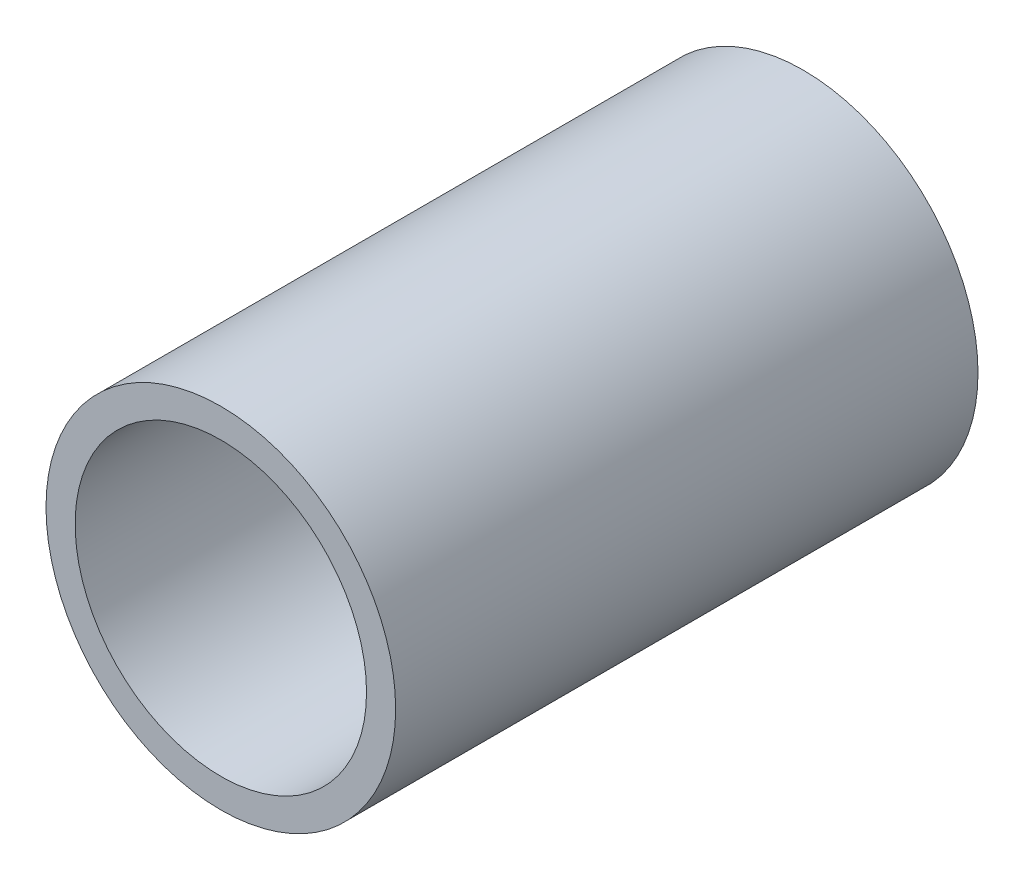
ISO-10303-21;
HEADER;
FILE_DESCRIPTION(('STEP AP214'),'2;1');
FILE_NAME('part.step','',(''),(''),'','','');
FILE_SCHEMA(('AUTOMOTIVE_DESIGN { 1 0 10303 214 1 1 1 1 }'));
ENDSEC;
DATA;
#1=APPLICATION_CONTEXT('core data for automotive mechanical design processes');
#2=APPLICATION_PROTOCOL_DEFINITION('international standard','automotive_design',2000,#1);
#3=PRODUCT_CONTEXT('',#1,'mechanical');
#4=PRODUCT('Part','Part','',(#3));
#5=PRODUCT_RELATED_PRODUCT_CATEGORY('part','',(#4));
#6=PRODUCT_DEFINITION_FORMATION('','',#4);
#7=PRODUCT_DEFINITION_CONTEXT('part definition',#1,'design');
#8=PRODUCT_DEFINITION('design','',#6,#7);
#9=PRODUCT_DEFINITION_SHAPE('','',#8);
#10=(LENGTH_UNIT() NAMED_UNIT(*) SI_UNIT(.MILLI.,.METRE.));
#11=(NAMED_UNIT(*) PLANE_ANGLE_UNIT() SI_UNIT($,.RADIAN.));
#12=(NAMED_UNIT(*) SI_UNIT($,.STERADIAN.) SOLID_ANGLE_UNIT());
#13=UNCERTAINTY_MEASURE_WITH_UNIT(LENGTH_MEASURE(1.E-05),#10,'distance_accuracy_value','');
#14=(GEOMETRIC_REPRESENTATION_CONTEXT(3) GLOBAL_UNCERTAINTY_ASSIGNED_CONTEXT((#13)) GLOBAL_UNIT_ASSIGNED_CONTEXT((#10,
#11,#12)) REPRESENTATION_CONTEXT('',''));
#15=CARTESIAN_POINT('',(0.,0.,0.));
#16=DIRECTION('',(0.,0.,1.));
#17=DIRECTION('',(1.,0.,0.));
#18=AXIS2_PLACEMENT_3D('',#15,#16,#17);
#19=CARTESIAN_POINT('',(0.,0.,31.75));
#20=DIRECTION('',(0.,0.,1.));
#21=DIRECTION('',(1.,0.,0.));
#22=AXIS2_PLACEMENT_3D('',#19,#20,#21);
#23=PLANE('',#22);
#24=CARTESIAN_POINT('',(0.,0.,31.75));
#25=DIRECTION('',(0.,0.,1.));
#26=DIRECTION('',(1.,0.,0.));
#27=AXIS2_PLACEMENT_3D('',#24,#25,#26);
#28=CIRCLE('',#27,19.0627);
#29=CARTESIAN_POINT('',(19.0627,0.,31.75));
#30=VERTEX_POINT('',#29);
#31=EDGE_CURVE('E10',#30,#30,#28,.T.);
#32=ORIENTED_EDGE('',*,*,#31,.T.);
#33=EDGE_LOOP('',(#32));
#34=FACE_BOUND('',#33,.T.);
#35=CARTESIAN_POINT('',(0.,0.,31.75));
#36=DIRECTION('',(0.,0.,1.));
#37=DIRECTION('',(1.,0.,0.));
#38=AXIS2_PLACEMENT_3D('',#35,#36,#37);
#39=CIRCLE('',#38,15.8877);
#40=CARTESIAN_POINT('',(15.8877,0.,31.75));
#41=VERTEX_POINT('',#40);
#42=EDGE_CURVE('E41',#41,#41,#39,.T.);
#43=ORIENTED_EDGE('',*,*,#42,.F.);
#44=EDGE_LOOP('',(#43));
#45=FACE_BOUND('',#44,.T.);
#46=ADVANCED_FACE('F30',(#34,#45),#23,.T.);
#47=CARTESIAN_POINT('',(0.,0.,-31.75));
#48=DIRECTION('',(0.,0.,1.));
#49=DIRECTION('',(1.,0.,0.));
#50=AXIS2_PLACEMENT_3D('',#47,#48,#49);
#51=PLANE('',#50);
#52=CARTESIAN_POINT('',(0.,0.,-31.75));
#53=DIRECTION('',(0.,0.,1.));
#54=DIRECTION('',(1.,0.,0.));
#55=AXIS2_PLACEMENT_3D('',#52,#53,#54);
#56=CIRCLE('',#55,19.0627);
#57=CARTESIAN_POINT('',(19.0627,0.,-31.75));
#58=VERTEX_POINT('',#57);
#59=EDGE_CURVE('E34',#58,#58,#56,.T.);
#60=ORIENTED_EDGE('',*,*,#59,.F.);
#61=EDGE_LOOP('',(#60));
#62=FACE_BOUND('',#61,.T.);
#63=CARTESIAN_POINT('',(0.,0.,-31.75));
#64=DIRECTION('',(0.,0.,1.));
#65=DIRECTION('',(1.,0.,0.));
#66=AXIS2_PLACEMENT_3D('',#63,#64,#65);
#67=CIRCLE('',#66,15.8877);
#68=CARTESIAN_POINT('',(15.8877,0.,-31.75));
#69=VERTEX_POINT('',#68);
#70=EDGE_CURVE('E43',#69,#69,#67,.T.);
#71=ORIENTED_EDGE('',*,*,#70,.T.);
#72=EDGE_LOOP('',(#71));
#73=FACE_BOUND('',#72,.T.);
#74=ADVANCED_FACE('F53',(#62,#73),#51,.F.);
#75=CARTESIAN_POINT('',(0.,0.,31.75));
#76=DIRECTION('',(0.,0.,-1.));
#77=DIRECTION('',(-1.,0.,0.));
#78=AXIS2_PLACEMENT_3D('',#75,#76,#77);
#79=CYLINDRICAL_SURFACE('',#78,19.0627);
#80=ORIENTED_EDGE('',*,*,#31,.F.);
#81=EDGE_LOOP('',(#80));
#82=FACE_BOUND('',#81,.T.);
#83=ORIENTED_EDGE('',*,*,#59,.T.);
#84=EDGE_LOOP('',(#83));
#85=FACE_BOUND('',#84,.T.);
#86=ADVANCED_FACE('F32',(#82,#85),#79,.T.);
#87=CARTESIAN_POINT('',(0.,0.,31.75));
#88=DIRECTION('',(0.,0.,-1.));
#89=DIRECTION('',(-1.,0.,0.));
#90=AXIS2_PLACEMENT_3D('',#87,#88,#89);
#91=CYLINDRICAL_SURFACE('',#90,15.8877);
#92=ORIENTED_EDGE('',*,*,#42,.T.);
#93=EDGE_LOOP('',(#92));
#94=FACE_BOUND('',#93,.T.);
#95=ORIENTED_EDGE('',*,*,#70,.F.);
#96=EDGE_LOOP('',(#95));
#97=FACE_BOUND('',#96,.T.);
#98=ADVANCED_FACE('F49',(#94,#97),#91,.F.);
#99=CLOSED_SHELL('',(#46,#74,#86,#98));
#100=MANIFOLD_SOLID_BREP('B2',#99);
#101=ADVANCED_BREP_SHAPE_REPRESENTATION('',(#18,#100),#14);
#102=SHAPE_DEFINITION_REPRESENTATION(#9,#101);
ENDSEC;
END-ISO-10303-21;
